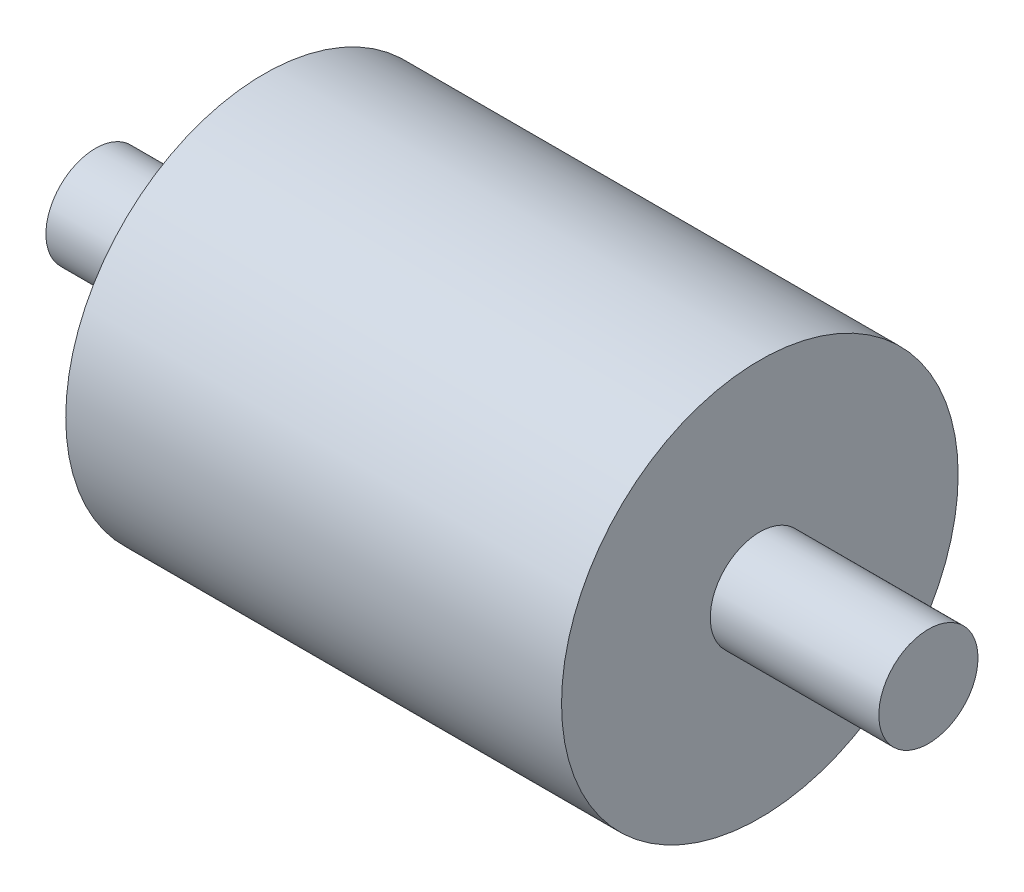
ISO-10303-21;
HEADER;
FILE_DESCRIPTION(('STEP AP214'),'2;1');
FILE_NAME('part.step','',(''),(''),'','','');
FILE_SCHEMA(('AUTOMOTIVE_DESIGN { 1 0 10303 214 1 1 1 1 }'));
ENDSEC;
DATA;
#1=APPLICATION_CONTEXT('core data for automotive mechanical design processes');
#2=APPLICATION_PROTOCOL_DEFINITION('international standard','automotive_design',2000,#1);
#3=PRODUCT_CONTEXT('',#1,'mechanical');
#4=PRODUCT('Part','Part','',(#3));
#5=PRODUCT_RELATED_PRODUCT_CATEGORY('part','',(#4));
#6=PRODUCT_DEFINITION_FORMATION('','',#4);
#7=PRODUCT_DEFINITION_CONTEXT('part definition',#1,'design');
#8=PRODUCT_DEFINITION('design','',#6,#7);
#9=PRODUCT_DEFINITION_SHAPE('','',#8);
#10=(LENGTH_UNIT() NAMED_UNIT(*) SI_UNIT(.MILLI.,.METRE.));
#11=(NAMED_UNIT(*) PLANE_ANGLE_UNIT() SI_UNIT($,.RADIAN.));
#12=(NAMED_UNIT(*) SI_UNIT($,.STERADIAN.) SOLID_ANGLE_UNIT());
#13=UNCERTAINTY_MEASURE_WITH_UNIT(LENGTH_MEASURE(1.E-05),#10,'distance_accuracy_value','');
#14=(GEOMETRIC_REPRESENTATION_CONTEXT(3) GLOBAL_UNCERTAINTY_ASSIGNED_CONTEXT((#13)) GLOBAL_UNIT_ASSIGNED_CONTEXT((#10,
#11,#12)) REPRESENTATION_CONTEXT('',''));
#15=CARTESIAN_POINT('',(0.,0.,0.));
#16=DIRECTION('',(0.,0.,1.));
#17=DIRECTION('',(1.,0.,0.));
#18=AXIS2_PLACEMENT_3D('',#15,#16,#17);
#19=CARTESIAN_POINT('',(25.,0.,0.));
#20=DIRECTION('',(-1.,0.,0.));
#21=DIRECTION('',(0.,0.,1.));
#22=AXIS2_PLACEMENT_3D('',#19,#20,#21);
#23=CYLINDRICAL_SURFACE('',#22,20.);
#24=CARTESIAN_POINT('',(25.,0.,0.));
#25=DIRECTION('',(1.,0.,0.));
#26=DIRECTION('',(0.,0.,-1.));
#27=AXIS2_PLACEMENT_3D('',#24,#25,#26);
#28=CIRCLE('',#27,20.);
#29=CARTESIAN_POINT('',(25.,0.,-20.));
#30=VERTEX_POINT('',#29);
#31=EDGE_CURVE('E38',#30,#30,#28,.T.);
#32=ORIENTED_EDGE('',*,*,#31,.F.);
#33=EDGE_LOOP('',(#32));
#34=FACE_BOUND('',#33,.T.);
#35=CARTESIAN_POINT('',(-25.,0.,0.));
#36=DIRECTION('',(1.,0.,0.));
#37=DIRECTION('',(0.,0.,-1.));
#38=AXIS2_PLACEMENT_3D('',#35,#36,#37);
#39=CIRCLE('',#38,20.);
#40=CARTESIAN_POINT('',(-25.,0.,-20.));
#41=VERTEX_POINT('',#40);
#42=EDGE_CURVE('E42',#41,#41,#39,.T.);
#43=ORIENTED_EDGE('',*,*,#42,.T.);
#44=EDGE_LOOP('',(#43));
#45=FACE_BOUND('',#44,.T.);
#46=ADVANCED_FACE('F32',(#34,#45),#23,.T.);
#47=CARTESIAN_POINT('',(25.,0.,0.));
#48=DIRECTION('',(1.,0.,0.));
#49=DIRECTION('',(0.,0.,-1.));
#50=AXIS2_PLACEMENT_3D('',#47,#48,#49);
#51=PLANE('',#50);
#52=CARTESIAN_POINT('',(25.,0.,0.));
#53=DIRECTION('',(1.,0.,0.));
#54=DIRECTION('',(0.,0.,-1.));
#55=AXIS2_PLACEMENT_3D('',#52,#53,#54);
#56=CIRCLE('',#55,5.);
#57=CARTESIAN_POINT('',(25.,0.,-5.));
#58=VERTEX_POINT('',#57);
#59=EDGE_CURVE('E47',#58,#58,#56,.F.);
#60=ORIENTED_EDGE('',*,*,#59,.T.);
#61=EDGE_LOOP('',(#60));
#62=FACE_BOUND('',#61,.T.);
#63=ORIENTED_EDGE('',*,*,#31,.T.);
#64=EDGE_LOOP('',(#63));
#65=FACE_BOUND('',#64,.T.);
#66=ADVANCED_FACE('F76',(#62,#65),#51,.T.);
#67=CARTESIAN_POINT('',(-25.,0.,0.));
#68=DIRECTION('',(1.,0.,0.));
#69=DIRECTION('',(0.,0.,-1.));
#70=AXIS2_PLACEMENT_3D('',#67,#68,#69);
#71=PLANE('',#70);
#72=CARTESIAN_POINT('',(-25.,0.,0.));
#73=DIRECTION('',(1.,0.,0.));
#74=DIRECTION('',(0.,0.,-1.));
#75=AXIS2_PLACEMENT_3D('',#72,#73,#74);
#76=CIRCLE('',#75,5.);
#77=CARTESIAN_POINT('',(-25.,0.,-5.));
#78=VERTEX_POINT('',#77);
#79=EDGE_CURVE('E10',#78,#78,#76,.F.);
#80=ORIENTED_EDGE('',*,*,#79,.F.);
#81=EDGE_LOOP('',(#80));
#82=FACE_BOUND('',#81,.T.);
#83=ORIENTED_EDGE('',*,*,#42,.F.);
#84=EDGE_LOOP('',(#83));
#85=FACE_BOUND('',#84,.T.);
#86=ADVANCED_FACE('F81',(#82,#85),#71,.F.);
#87=CARTESIAN_POINT('',(-42.,0.,0.));
#88=DIRECTION('',(1.,0.,0.));
#89=DIRECTION('',(0.,0.,-1.));
#90=AXIS2_PLACEMENT_3D('',#87,#88,#89);
#91=PLANE('',#90);
#92=CARTESIAN_POINT('',(-42.,0.,0.));
#93=DIRECTION('',(1.,0.,0.));
#94=DIRECTION('',(0.,0.,-1.));
#95=AXIS2_PLACEMENT_3D('',#92,#93,#94);
#96=CIRCLE('',#95,5.);
#97=CARTESIAN_POINT('',(-42.,0.,-5.));
#98=VERTEX_POINT('',#97);
#99=EDGE_CURVE('E52',#98,#98,#96,.T.);
#100=ORIENTED_EDGE('',*,*,#99,.F.);
#101=EDGE_LOOP('',(#100));
#102=FACE_BOUND('',#101,.T.);
#103=ADVANCED_FACE('F70',(#102),#91,.F.);
#104=CARTESIAN_POINT('',(42.,0.,0.));
#105=DIRECTION('',(-1.,0.,0.));
#106=DIRECTION('',(0.,0.,1.));
#107=AXIS2_PLACEMENT_3D('',#104,#105,#106);
#108=CYLINDRICAL_SURFACE('',#107,5.);
#109=ORIENTED_EDGE('',*,*,#99,.T.);
#110=EDGE_LOOP('',(#109));
#111=FACE_BOUND('',#110,.T.);
#112=ORIENTED_EDGE('',*,*,#79,.T.);
#113=EDGE_LOOP('',(#112));
#114=FACE_BOUND('',#113,.T.);
#115=ADVANCED_FACE('F62',(#111,#114),#108,.T.);
#116=ORIENTED_EDGE('',*,*,#59,.F.);
#117=EDGE_LOOP('',(#116));
#118=FACE_BOUND('',#117,.T.);
#119=CARTESIAN_POINT('',(42.,0.,0.));
#120=DIRECTION('',(1.,0.,0.));
#121=DIRECTION('',(0.,0.,-1.));
#122=AXIS2_PLACEMENT_3D('',#119,#120,#121);
#123=CIRCLE('',#122,5.);
#124=CARTESIAN_POINT('',(42.,0.,-5.));
#125=VERTEX_POINT('',#124);
#126=EDGE_CURVE('E51',#125,#125,#123,.T.);
#127=ORIENTED_EDGE('',*,*,#126,.F.);
#128=EDGE_LOOP('',(#127));
#129=FACE_BOUND('',#128,.T.);
#130=ADVANCED_FACE('F60',(#118,#129),#108,.T.);
#131=CARTESIAN_POINT('',(42.,0.,0.));
#132=DIRECTION('',(1.,0.,0.));
#133=DIRECTION('',(0.,0.,-1.));
#134=AXIS2_PLACEMENT_3D('',#131,#132,#133);
#135=PLANE('',#134);
#136=ORIENTED_EDGE('',*,*,#126,.T.);
#137=EDGE_LOOP('',(#136));
#138=FACE_BOUND('',#137,.T.);
#139=ADVANCED_FACE('F58',(#138),#135,.T.);
#140=CLOSED_SHELL('',(#46,#66,#86,#103,#115,#130,#139));
#141=MANIFOLD_SOLID_BREP('B2',#140);
#142=ADVANCED_BREP_SHAPE_REPRESENTATION('',(#18,#141),#14);
#143=SHAPE_DEFINITION_REPRESENTATION(#9,#142);
ENDSEC;
END-ISO-10303-21;
